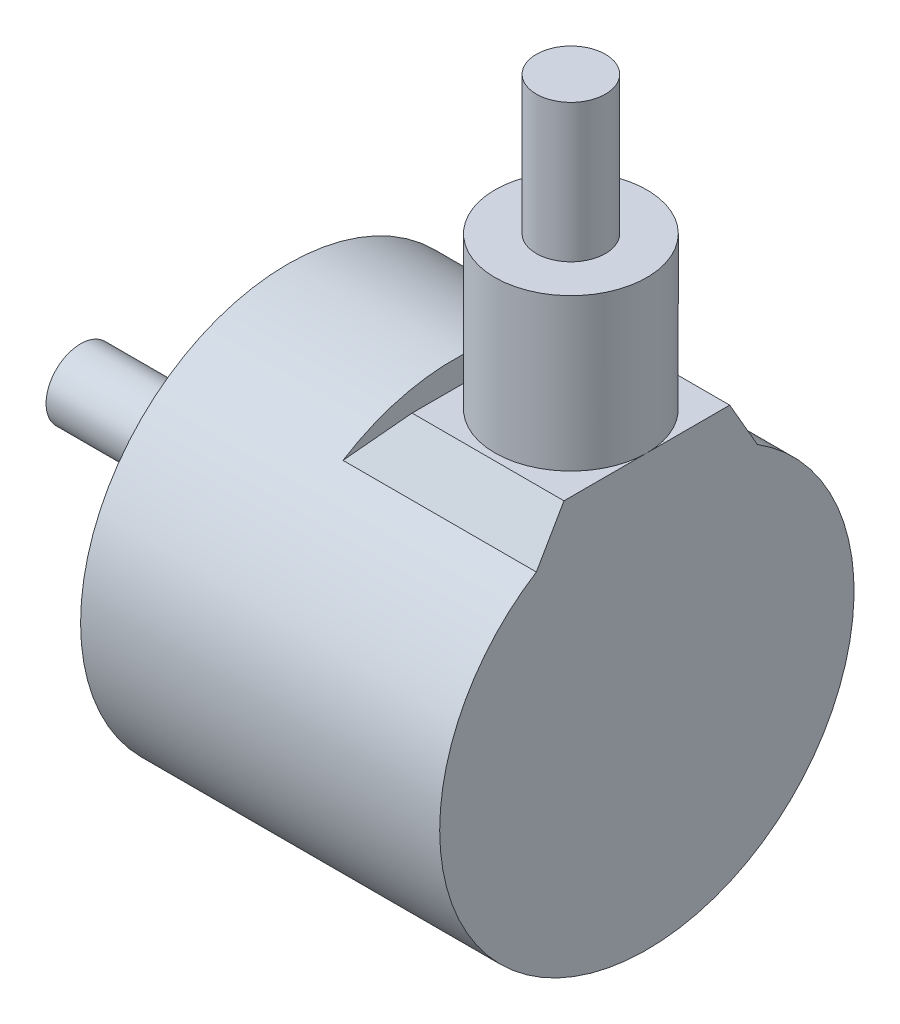
ISO-10303-21;
HEADER;
FILE_DESCRIPTION(('STEP AP214'),'2;1');
FILE_NAME('part.step','',(''),(''),'','','');
FILE_SCHEMA(('AUTOMOTIVE_DESIGN { 1 0 10303 214 1 1 1 1 }'));
ENDSEC;
DATA;
#1=APPLICATION_CONTEXT('core data for automotive mechanical design processes');
#2=APPLICATION_PROTOCOL_DEFINITION('international standard','automotive_design',2000,#1);
#3=PRODUCT_CONTEXT('',#1,'mechanical');
#4=PRODUCT('Part','Part','',(#3));
#5=PRODUCT_RELATED_PRODUCT_CATEGORY('part','',(#4));
#6=PRODUCT_DEFINITION_FORMATION('','',#4);
#7=PRODUCT_DEFINITION_CONTEXT('part definition',#1,'design');
#8=PRODUCT_DEFINITION('design','',#6,#7);
#9=PRODUCT_DEFINITION_SHAPE('','',#8);
#10=(LENGTH_UNIT() NAMED_UNIT(*) SI_UNIT(.MILLI.,.METRE.));
#11=(NAMED_UNIT(*) PLANE_ANGLE_UNIT() SI_UNIT($,.RADIAN.));
#12=(NAMED_UNIT(*) SI_UNIT($,.STERADIAN.) SOLID_ANGLE_UNIT());
#13=UNCERTAINTY_MEASURE_WITH_UNIT(LENGTH_MEASURE(1.E-05),#10,'distance_accuracy_value','');
#14=(GEOMETRIC_REPRESENTATION_CONTEXT(3) GLOBAL_UNCERTAINTY_ASSIGNED_CONTEXT((#13)) GLOBAL_UNIT_ASSIGNED_CONTEXT((#10,
#11,#12)) REPRESENTATION_CONTEXT('',''));
#15=CARTESIAN_POINT('',(0.,0.,0.));
#16=DIRECTION('',(0.,0.,1.));
#17=DIRECTION('',(1.,0.,0.));
#18=AXIS2_PLACEMENT_3D('',#15,#16,#17);
#19=CARTESIAN_POINT('',(-19.0552292361064,27.1526791555873,0.));
#20=DIRECTION('',(0.,1.,0.));
#21=DIRECTION('',(0.,0.,1.));
#22=AXIS2_PLACEMENT_3D('',#19,#20,#21);
#23=PLANE('',#22);
#24=CARTESIAN_POINT('',(-19.0552292361064,27.1526791555873,0.));
#25=DIRECTION('',(0.,1.,0.));
#26=DIRECTION('',(0.,0.,1.));
#27=AXIS2_PLACEMENT_3D('',#24,#25,#26);
#28=CIRCLE('',#27,5.5);
#29=CARTESIAN_POINT('',(-19.0552292361064,27.1526791555873,5.49999999999999));
#30=VERTEX_POINT('',#29);
#31=EDGE_CURVE('E103',#30,#30,#28,.T.);
#32=ORIENTED_EDGE('',*,*,#31,.T.);
#33=EDGE_LOOP('',(#32));
#34=FACE_BOUND('',#33,.T.);
#35=CARTESIAN_POINT('',(-19.0552292361064,27.1526791555873,0.));
#36=DIRECTION('',(0.,1.,0.));
#37=DIRECTION('',(0.,0.,1.));
#38=AXIS2_PLACEMENT_3D('',#35,#36,#37);
#39=CIRCLE('',#38,2.5);
#40=CARTESIAN_POINT('',(-19.0552292361064,27.1526791555873,2.49999999999999));
#41=VERTEX_POINT('',#40);
#42=EDGE_CURVE('E138',#41,#41,#39,.T.);
#43=ORIENTED_EDGE('',*,*,#42,.F.);
#44=EDGE_LOOP('',(#43));
#45=FACE_BOUND('',#44,.T.);
#46=ADVANCED_FACE('F33',(#34,#45),#23,.T.);
#47=CARTESIAN_POINT('',(-13.5552292361064,16.1526791555873,6.));
#48=DIRECTION('',(0.,-1.,0.));
#49=DIRECTION('',(0.,0.,-1.));
#50=AXIS2_PLACEMENT_3D('',#47,#48,#49);
#51=PLANE('',#50);
#52=CARTESIAN_POINT('',(-19.0552292361064,16.1526791555873,0.));
#53=DIRECTION('',(0.,1.,0.));
#54=DIRECTION('',(0.,0.,1.));
#55=AXIS2_PLACEMENT_3D('',#52,#53,#54);
#56=CIRCLE('',#55,5.5);
#57=CARTESIAN_POINT('',(-13.5552292361064,16.1526791555873,0.));
#58=VERTEX_POINT('',#57);
#59=CARTESIAN_POINT('',(-24.5552292361064,16.1526791555873,0.));
#60=VERTEX_POINT('',#59);
#61=EDGE_CURVE('E100',#58,#60,#56,.T.);
#62=ORIENTED_EDGE('',*,*,#61,.F.);
#63=DIRECTION('',(0.,0.,1.));
#64=VECTOR('',#63,1.);
#65=CARTESIAN_POINT('',(-13.5552292361064,16.1526791555873,6.));
#66=LINE('',#65,#64);
#67=CARTESIAN_POINT('',(-13.5552292361064,16.1526791555873,-6.));
#68=VERTEX_POINT('',#67);
#69=EDGE_CURVE('E81',#68,#58,#66,.T.);
#70=ORIENTED_EDGE('',*,*,#69,.F.);
#71=DIRECTION('',(-1.,0.,0.));
#72=VECTOR('',#71,1.);
#73=CARTESIAN_POINT('',(-13.5552292361064,16.1526791555873,-6.));
#74=LINE('',#73,#72);
#75=CARTESIAN_POINT('',(-24.5552292361064,16.1526791555873,-6.));
#76=VERTEX_POINT('',#75);
#77=EDGE_CURVE('E98',#68,#76,#74,.T.);
#78=ORIENTED_EDGE('',*,*,#77,.T.);
#79=DIRECTION('',(0.,0.,-1.));
#80=VECTOR('',#79,1.);
#81=CARTESIAN_POINT('',(-24.5552292361064,16.1526791555873,10.));
#82=LINE('',#81,#80);
#83=EDGE_CURVE('E54',#60,#76,#82,.T.);
#84=ORIENTED_EDGE('',*,*,#83,.F.);
#85=EDGE_LOOP('',(#62,#70,#78,#84));
#86=FACE_BOUND('',#85,.T.);
#87=ADVANCED_FACE('F101',(#86),#51,.F.);
#88=EDGE_CURVE('E12',#60,#58,#56,.T.);
#89=ORIENTED_EDGE('',*,*,#88,.F.);
#90=CARTESIAN_POINT('',(-24.5552292361064,16.1526791555873,6.));
#91=VERTEX_POINT('',#90);
#92=EDGE_CURVE('E147',#91,#60,#82,.T.);
#93=ORIENTED_EDGE('',*,*,#92,.F.);
#94=DIRECTION('',(-1.,0.,0.));
#95=VECTOR('',#94,1.);
#96=CARTESIAN_POINT('',(-13.5552292361064,16.1526791555873,6.));
#97=LINE('',#96,#95);
#98=CARTESIAN_POINT('',(-13.5552292361064,16.1526791555873,6.));
#99=VERTEX_POINT('',#98);
#100=EDGE_CURVE('E97',#99,#91,#97,.T.);
#101=ORIENTED_EDGE('',*,*,#100,.F.);
#102=EDGE_CURVE('E83',#58,#99,#66,.T.);
#103=ORIENTED_EDGE('',*,*,#102,.F.);
#104=EDGE_LOOP('',(#89,#93,#101,#103));
#105=FACE_BOUND('',#104,.T.);
#106=ADVANCED_FACE('F95',(#105),#51,.F.);
#107=CARTESIAN_POINT('',(-72.5210660272544,0.,0.));
#108=DIRECTION('',(-1.,0.,0.));
#109=DIRECTION('',(0.,0.,1.));
#110=AXIS2_PLACEMENT_3D('',#107,#108,#109);
#111=CYLINDRICAL_SURFACE('',#110,15.);
#112=CARTESIAN_POINT('',(-39.5552292361064,0.,0.));
#113=DIRECTION('',(-1.,0.,0.));
#114=DIRECTION('',(0.,0.,1.));
#115=AXIS2_PLACEMENT_3D('',#112,#113,#114);
#116=CIRCLE('',#115,15.);
#117=CARTESIAN_POINT('',(-39.5552292361064,0.,15.));
#118=VERTEX_POINT('',#117);
#119=EDGE_CURVE('E194',#118,#118,#116,.T.);
#120=ORIENTED_EDGE('',*,*,#119,.F.);
#121=EDGE_LOOP('',(#120));
#122=FACE_BOUND('',#121,.T.);
#123=DIRECTION('',(-1.,0.,0.));
#124=VECTOR('',#123,1.);
#125=CARTESIAN_POINT('',(-13.5552292361064,12.6885775404495,-8.));
#126=LINE('',#125,#124);
#127=CARTESIAN_POINT('',(-13.5552292361064,12.6885775404495,-7.99999999999999));
#128=VERTEX_POINT('',#127);
#129=CARTESIAN_POINT('',(-27.5552292361064,12.6885775404495,-8.00000000000001));
#130=VERTEX_POINT('',#129);
#131=EDGE_CURVE('E92',#128,#130,#126,.T.);
#132=ORIENTED_EDGE('',*,*,#131,.F.);
#133=CARTESIAN_POINT('',(-13.5552292361064,0.,0.));
#134=DIRECTION('',(-1.,0.,0.));
#135=DIRECTION('',(0.,0.,1.));
#136=AXIS2_PLACEMENT_3D('',#133,#134,#135);
#137=CIRCLE('',#136,15.);
#138=CARTESIAN_POINT('',(-13.5552292361064,12.6885775404495,8.));
#139=VERTEX_POINT('',#138);
#140=EDGE_CURVE('E197',#128,#139,#137,.T.);
#141=ORIENTED_EDGE('',*,*,#140,.T.);
#142=DIRECTION('',(-1.,0.,0.));
#143=VECTOR('',#142,1.);
#144=CARTESIAN_POINT('',(-13.5552292361064,12.6885775404495,8.));
#145=LINE('',#144,#143);
#146=CARTESIAN_POINT('',(-27.5552292361064,12.6885775404495,7.99999999999999));
#147=VERTEX_POINT('',#146);
#148=EDGE_CURVE('E152',#139,#147,#145,.T.);
#149=ORIENTED_EDGE('',*,*,#148,.T.);
#150=CARTESIAN_POINT('',(-27.5552292361064,0.,0.));
#151=DIRECTION('',(-1.,0.,0.));
#152=DIRECTION('',(0.,0.,1.));
#153=AXIS2_PLACEMENT_3D('',#150,#151,#152);
#154=CIRCLE('',#153,15.);
#155=EDGE_CURVE('E42',#147,#130,#154,.T.);
#156=ORIENTED_EDGE('',*,*,#155,.T.);
#157=EDGE_LOOP('',(#132,#141,#149,#156));
#158=FACE_BOUND('',#157,.T.);
#159=ADVANCED_FACE('F217',(#122,#158),#111,.T.);
#160=CARTESIAN_POINT('',(-39.5552292361064,15.,0.));
#161=DIRECTION('',(1.,0.,0.));
#162=DIRECTION('',(0.,0.,-1.));
#163=AXIS2_PLACEMENT_3D('',#160,#161,#162);
#164=PLANE('',#163);
#165=ORIENTED_EDGE('',*,*,#119,.T.);
#166=EDGE_LOOP('',(#165));
#167=FACE_BOUND('',#166,.T.);
#168=CARTESIAN_POINT('',(-39.5552292361064,-12.,0.));
#169=DIRECTION('',(-1.,0.,0.));
#170=DIRECTION('',(0.,0.,1.));
#171=AXIS2_PLACEMENT_3D('',#168,#169,#170);
#172=CIRCLE('',#171,1.5);
#173=CARTESIAN_POINT('',(-39.5552292361064,-12.,1.5));
#174=VERTEX_POINT('',#173);
#175=EDGE_CURVE('E183',#174,#174,#172,.T.);
#176=ORIENTED_EDGE('',*,*,#175,.F.);
#177=EDGE_LOOP('',(#176));
#178=FACE_BOUND('',#177,.T.);
#179=CARTESIAN_POINT('',(-39.5552292361064,6.00000000000005,10.3923048454132));
#180=DIRECTION('',(-1.,0.,0.));
#181=DIRECTION('',(0.,0.866025403784436,-0.500000000000004));
#182=AXIS2_PLACEMENT_3D('',#179,#180,#181);
#183=CIRCLE('',#182,1.5);
#184=CARTESIAN_POINT('',(-39.5552292361064,7.2990381056767,9.64230484541323));
#185=VERTEX_POINT('',#184);
#186=EDGE_CURVE('E176',#185,#185,#183,.T.);
#187=ORIENTED_EDGE('',*,*,#186,.F.);
#188=EDGE_LOOP('',(#187));
#189=FACE_BOUND('',#188,.T.);
#190=CARTESIAN_POINT('',(-39.5552292361064,5.9999999999999,-10.3923048454133));
#191=DIRECTION('',(-1.,0.,0.));
#192=DIRECTION('',(0.,-0.866025403784443,-0.499999999999992));
#193=AXIS2_PLACEMENT_3D('',#190,#191,#192);
#194=CIRCLE('',#193,1.5);
#195=CARTESIAN_POINT('',(-39.5552292361064,4.70096189432324,-11.1423048454133));
#196=VERTEX_POINT('',#195);
#197=EDGE_CURVE('E177',#196,#196,#194,.T.);
#198=ORIENTED_EDGE('',*,*,#197,.F.);
#199=EDGE_LOOP('',(#198));
#200=FACE_BOUND('',#199,.T.);
#201=CARTESIAN_POINT('',(-39.5552292361064,0.,0.));
#202=DIRECTION('',(1.,0.,0.));
#203=DIRECTION('',(0.,0.,-1.));
#204=AXIS2_PLACEMENT_3D('',#201,#202,#203);
#205=CIRCLE('',#204,8.);
#206=CARTESIAN_POINT('',(-39.5552292361064,0.,-8.));
#207=VERTEX_POINT('',#206);
#208=EDGE_CURVE('E200',#207,#207,#205,.F.);
#209=ORIENTED_EDGE('',*,*,#208,.F.);
#210=EDGE_LOOP('',(#209));
#211=FACE_BOUND('',#210,.T.);
#212=ADVANCED_FACE('F299',(#167,#178,#189,#200,#211),#164,.F.);
#213=CARTESIAN_POINT('',(-13.5552292361064,0.,0.));
#214=DIRECTION('',(-1.,0.,0.));
#215=DIRECTION('',(0.,0.,1.));
#216=AXIS2_PLACEMENT_3D('',#213,#214,#215);
#217=PLANE('',#216);
#218=DIRECTION('',(0.,-0.866025403784439,0.499999999999999));
#219=VECTOR('',#218,1.);
#220=CARTESIAN_POINT('',(-13.5552292361064,12.6885775404495,8.));
#221=LINE('',#220,#219);
#222=EDGE_CURVE('E166',#99,#139,#221,.T.);
#223=ORIENTED_EDGE('',*,*,#222,.T.);
#224=ORIENTED_EDGE('',*,*,#140,.F.);
#225=DIRECTION('',(0.,0.866025403784438,0.500000000000001));
#226=VECTOR('',#225,1.);
#227=CARTESIAN_POINT('',(-13.5552292361064,16.1526791555873,-6.));
#228=LINE('',#227,#226);
#229=EDGE_CURVE('E87',#128,#68,#228,.T.);
#230=ORIENTED_EDGE('',*,*,#229,.T.);
#231=ORIENTED_EDGE('',*,*,#69,.T.);
#232=ORIENTED_EDGE('',*,*,#102,.T.);
#233=EDGE_LOOP('',(#223,#224,#230,#231,#232));
#234=FACE_BOUND('',#233,.T.);
#235=ADVANCED_FACE('F35',(#234),#217,.F.);
#236=CARTESIAN_POINT('',(-34.5552292361064,-12.,0.));
#237=DIRECTION('',(-1.,0.,0.));
#238=DIRECTION('',(0.,0.,1.));
#239=AXIS2_PLACEMENT_3D('',#236,#237,#238);
#240=CYLINDRICAL_SURFACE('',#239,1.5);
#241=CARTESIAN_POINT('',(-34.5552292361064,-12.,0.));
#242=DIRECTION('',(-1.,0.,0.));
#243=DIRECTION('',(0.,0.,1.));
#244=AXIS2_PLACEMENT_3D('',#241,#242,#243);
#245=CIRCLE('',#244,1.5);
#246=CARTESIAN_POINT('',(-34.5552292361064,-12.,1.5));
#247=VERTEX_POINT('',#246);
#248=EDGE_CURVE('E186',#247,#247,#245,.T.);
#249=ORIENTED_EDGE('',*,*,#248,.F.);
#250=EDGE_LOOP('',(#249));
#251=FACE_BOUND('',#250,.T.);
#252=ORIENTED_EDGE('',*,*,#175,.T.);
#253=EDGE_LOOP('',(#252));
#254=FACE_BOUND('',#253,.T.);
#255=ADVANCED_FACE('F314',(#251,#254),#240,.F.);
#256=CARTESIAN_POINT('',(-34.5552292361064,-12.,0.));
#257=DIRECTION('',(-1.,0.,0.));
#258=DIRECTION('',(0.,0.,1.));
#259=AXIS2_PLACEMENT_3D('',#256,#257,#258);
#260=PLANE('',#259);
#261=ORIENTED_EDGE('',*,*,#248,.T.);
#262=EDGE_LOOP('',(#261));
#263=FACE_BOUND('',#262,.T.);
#264=ADVANCED_FACE('F318',(#263),#260,.T.);
#265=CARTESIAN_POINT('',(-34.5552292361064,6.00000000000005,10.3923048454132));
#266=DIRECTION('',(-1.,0.,0.));
#267=DIRECTION('',(0.,0.,1.));
#268=AXIS2_PLACEMENT_3D('',#265,#266,#267);
#269=CYLINDRICAL_SURFACE('',#268,1.5);
#270=CARTESIAN_POINT('',(-34.5552292361064,6.00000000000005,10.3923048454132));
#271=DIRECTION('',(-1.,0.,0.));
#272=DIRECTION('',(0.,0.866025403784436,-0.500000000000004));
#273=AXIS2_PLACEMENT_3D('',#270,#271,#272);
#274=CIRCLE('',#273,1.5);
#275=CARTESIAN_POINT('',(-34.5552292361064,7.2990381056767,9.64230484541323));
#276=VERTEX_POINT('',#275);
#277=EDGE_CURVE('E180',#276,#276,#274,.T.);
#278=ORIENTED_EDGE('',*,*,#277,.F.);
#279=EDGE_LOOP('',(#278));
#280=FACE_BOUND('',#279,.T.);
#281=ORIENTED_EDGE('',*,*,#186,.T.);
#282=EDGE_LOOP('',(#281));
#283=FACE_BOUND('',#282,.T.);
#284=ADVANCED_FACE('F327',(#280,#283),#269,.F.);
#285=CARTESIAN_POINT('',(-34.5552292361064,6.00000000000005,10.3923048454132));
#286=DIRECTION('',(-1.,0.,0.));
#287=DIRECTION('',(0.,0.866025403784436,-0.500000000000004));
#288=AXIS2_PLACEMENT_3D('',#285,#286,#287);
#289=PLANE('',#288);
#290=ORIENTED_EDGE('',*,*,#277,.T.);
#291=EDGE_LOOP('',(#290));
#292=FACE_BOUND('',#291,.T.);
#293=ADVANCED_FACE('F335',(#292),#289,.T.);
#294=CARTESIAN_POINT('',(-34.5552292361064,5.9999999999999,-10.3923048454133));
#295=DIRECTION('',(-1.,0.,0.));
#296=DIRECTION('',(0.,0.,1.));
#297=AXIS2_PLACEMENT_3D('',#294,#295,#296);
#298=CYLINDRICAL_SURFACE('',#297,1.5);
#299=CARTESIAN_POINT('',(-34.5552292361064,5.9999999999999,-10.3923048454133));
#300=DIRECTION('',(-1.,0.,0.));
#301=DIRECTION('',(0.,-0.866025403784443,-0.499999999999992));
#302=AXIS2_PLACEMENT_3D('',#299,#300,#301);
#303=CIRCLE('',#302,1.5);
#304=CARTESIAN_POINT('',(-34.5552292361064,4.70096189432324,-11.1423048454133));
#305=VERTEX_POINT('',#304);
#306=EDGE_CURVE('E173',#305,#305,#303,.T.);
#307=ORIENTED_EDGE('',*,*,#306,.F.);
#308=EDGE_LOOP('',(#307));
#309=FACE_BOUND('',#308,.T.);
#310=ORIENTED_EDGE('',*,*,#197,.T.);
#311=EDGE_LOOP('',(#310));
#312=FACE_BOUND('',#311,.T.);
#313=ADVANCED_FACE('F343',(#309,#312),#298,.F.);
#314=CARTESIAN_POINT('',(-34.5552292361064,5.9999999999999,-10.3923048454133));
#315=DIRECTION('',(-1.,0.,0.));
#316=DIRECTION('',(0.,-0.866025403784443,-0.499999999999992));
#317=AXIS2_PLACEMENT_3D('',#314,#315,#316);
#318=PLANE('',#317);
#319=ORIENTED_EDGE('',*,*,#306,.T.);
#320=EDGE_LOOP('',(#319));
#321=FACE_BOUND('',#320,.T.);
#322=ADVANCED_FACE('F351',(#321),#318,.T.);
#323=CARTESIAN_POINT('',(-41.5552292361064,0.,0.));
#324=DIRECTION('',(-1.,0.,0.));
#325=DIRECTION('',(0.,0.,1.));
#326=AXIS2_PLACEMENT_3D('',#323,#324,#325);
#327=PLANE('',#326);
#328=CARTESIAN_POINT('',(-41.5552292361064,0.,0.));
#329=DIRECTION('',(-1.,0.,0.));
#330=DIRECTION('',(0.,0.,1.));
#331=AXIS2_PLACEMENT_3D('',#328,#329,#330);
#332=CIRCLE('',#331,8.);
#333=CARTESIAN_POINT('',(-41.5552292361064,0.,8.));
#334=VERTEX_POINT('',#333);
#335=EDGE_CURVE('E169',#334,#334,#332,.T.);
#336=ORIENTED_EDGE('',*,*,#335,.T.);
#337=EDGE_LOOP('',(#336));
#338=FACE_BOUND('',#337,.T.);
#339=CARTESIAN_POINT('',(-41.5552292361064,0.,0.));
#340=DIRECTION('',(-1.,0.,0.));
#341=DIRECTION('',(0.,0.,1.));
#342=AXIS2_PLACEMENT_3D('',#339,#340,#341);
#343=CIRCLE('',#342,2.49999999999999);
#344=CARTESIAN_POINT('',(-41.5552292361064,0.,2.49999999999999));
#345=VERTEX_POINT('',#344);
#346=EDGE_CURVE('E172',#345,#345,#343,.T.);
#347=ORIENTED_EDGE('',*,*,#346,.F.);
#348=EDGE_LOOP('',(#347));
#349=FACE_BOUND('',#348,.T.);
#350=ADVANCED_FACE('F358',(#338,#349),#327,.T.);
#351=CARTESIAN_POINT('',(-41.5552292361064,0.,0.));
#352=DIRECTION('',(1.,0.,0.));
#353=DIRECTION('',(0.,0.,-1.));
#354=AXIS2_PLACEMENT_3D('',#351,#352,#353);
#355=CYLINDRICAL_SURFACE('',#354,8.);
#356=ORIENTED_EDGE('',*,*,#335,.F.);
#357=EDGE_LOOP('',(#356));
#358=FACE_BOUND('',#357,.T.);
#359=ORIENTED_EDGE('',*,*,#208,.T.);
#360=EDGE_LOOP('',(#359));
#361=FACE_BOUND('',#360,.T.);
#362=ADVANCED_FACE('F365',(#358,#361),#355,.T.);
#363=CARTESIAN_POINT('',(-54.5552292361064,2.49999999999999,0.));
#364=DIRECTION('',(1.,0.,0.));
#365=DIRECTION('',(0.,0.,-1.));
#366=AXIS2_PLACEMENT_3D('',#363,#364,#365);
#367=PLANE('',#366);
#368=CARTESIAN_POINT('',(-54.5552292361064,0.,0.));
#369=DIRECTION('',(-1.,0.,0.));
#370=DIRECTION('',(0.,0.,1.));
#371=AXIS2_PLACEMENT_3D('',#368,#369,#370);
#372=CIRCLE('',#371,2.49999999999999);
#373=CARTESIAN_POINT('',(-54.5552292361064,0.,2.49999999999999));
#374=VERTEX_POINT('',#373);
#375=EDGE_CURVE('E189',#374,#374,#372,.T.);
#376=ORIENTED_EDGE('',*,*,#375,.T.);
#377=EDGE_LOOP('',(#376));
#378=FACE_BOUND('',#377,.T.);
#379=ADVANCED_FACE('F243',(#378),#367,.F.);
#380=CARTESIAN_POINT('',(-72.5210660272544,0.,0.));
#381=DIRECTION('',(-1.,0.,0.));
#382=DIRECTION('',(0.,0.,1.));
#383=AXIS2_PLACEMENT_3D('',#380,#381,#382);
#384=CYLINDRICAL_SURFACE('',#383,2.49999999999999);
#385=ORIENTED_EDGE('',*,*,#346,.T.);
#386=EDGE_LOOP('',(#385));
#387=FACE_BOUND('',#386,.T.);
#388=ORIENTED_EDGE('',*,*,#375,.F.);
#389=EDGE_LOOP('',(#388));
#390=FACE_BOUND('',#389,.T.);
#391=ADVANCED_FACE('F236',(#387,#390),#384,.T.);
#392=CARTESIAN_POINT('',(-13.5552292361064,12.6885775404495,8.));
#393=DIRECTION('',(0.,-0.499999999999999,-0.866025403784439));
#394=DIRECTION('',(0.,0.866025403784439,-0.499999999999999));
#395=AXIS2_PLACEMENT_3D('',#392,#393,#394);
#396=PLANE('',#395);
#397=ORIENTED_EDGE('',*,*,#100,.T.);
#398=DIRECTION('',(-0.599999999999996,-0.692820323027554,0.400000000000001));
#399=VECTOR('',#398,1.);
#400=CARTESIAN_POINT('',(-22.5152292361065,18.5082682538809,4.64000000000002));
#401=LINE('',#400,#399);
#402=EDGE_CURVE('E155',#91,#147,#401,.T.);
#403=ORIENTED_EDGE('',*,*,#402,.T.);
#404=ORIENTED_EDGE('',*,*,#148,.F.);
#405=ORIENTED_EDGE('',*,*,#222,.F.);
#406=EDGE_LOOP('',(#397,#403,#404,#405));
#407=FACE_BOUND('',#406,.T.);
#408=ADVANCED_FACE('F234',(#407),#396,.F.);
#409=CARTESIAN_POINT('',(-13.5552292361064,16.1526791555873,-6.));
#410=DIRECTION('',(0.,-0.500000000000001,0.866025403784438));
#411=DIRECTION('',(0.,-0.866025403784438,-0.500000000000001));
#412=AXIS2_PLACEMENT_3D('',#409,#410,#411);
#413=PLANE('',#412);
#414=ORIENTED_EDGE('',*,*,#131,.T.);
#415=DIRECTION('',(-0.599999999999996,-0.692820323027554,-0.400000000000002));
#416=VECTOR('',#415,1.);
#417=CARTESIAN_POINT('',(-27.5552292361064,12.6885775404495,-8.00000000000001));
#418=LINE('',#417,#416);
#419=EDGE_CURVE('E143',#76,#130,#418,.T.);
#420=ORIENTED_EDGE('',*,*,#419,.F.);
#421=ORIENTED_EDGE('',*,*,#77,.F.);
#422=ORIENTED_EDGE('',*,*,#229,.F.);
#423=EDGE_LOOP('',(#414,#420,#421,#422));
#424=FACE_BOUND('',#423,.T.);
#425=ADVANCED_FACE('F220',(#424),#413,.F.);
#426=CARTESIAN_POINT('',(-27.5552292361064,16.1526791555873,10.));
#427=DIRECTION('',(-1.,0.,0.));
#428=DIRECTION('',(0.,-1.,0.));
#429=AXIS2_PLACEMENT_3D('',#426,#427,#428);
#430=PLANE('',#429);
#431=DIRECTION('',(0.,0.,-1.));
#432=VECTOR('',#431,1.);
#433=CARTESIAN_POINT('',(-27.5552292361064,12.6885775404495,7.99999999999999));
#434=LINE('',#433,#432);
#435=EDGE_CURVE('E149',#147,#130,#434,.T.);
#436=ORIENTED_EDGE('',*,*,#435,.T.);
#437=ORIENTED_EDGE('',*,*,#155,.F.);
#438=EDGE_LOOP('',(#436,#437));
#439=FACE_BOUND('',#438,.T.);
#440=ADVANCED_FACE('F119',(#439),#430,.F.);
#441=CARTESIAN_POINT('',(-27.5552292361064,12.6885775404495,7.99999999999999));
#442=DIRECTION('',(0.755928946018458,-0.654653670707973,0.));
#443=DIRECTION('',(0.654653670707973,0.755928946018458,0.));
#444=AXIS2_PLACEMENT_3D('',#441,#442,#443);
#445=PLANE('',#444);
#446=ORIENTED_EDGE('',*,*,#92,.T.);
#447=ORIENTED_EDGE('',*,*,#83,.T.);
#448=ORIENTED_EDGE('',*,*,#419,.T.);
#449=ORIENTED_EDGE('',*,*,#435,.F.);
#450=ORIENTED_EDGE('',*,*,#402,.F.);
#451=EDGE_LOOP('',(#446,#447,#448,#449,#450));
#452=FACE_BOUND('',#451,.T.);
#453=ADVANCED_FACE('F109',(#452),#445,.F.);
#454=CARTESIAN_POINT('',(-19.0552292361064,27.1526791555873,0.));
#455=DIRECTION('',(0.,-1.,0.));
#456=DIRECTION('',(0.,0.,-1.));
#457=AXIS2_PLACEMENT_3D('',#454,#455,#456);
#458=CYLINDRICAL_SURFACE('',#457,5.5);
#459=ORIENTED_EDGE('',*,*,#31,.F.);
#460=EDGE_LOOP('',(#459));
#461=FACE_BOUND('',#460,.T.);
#462=ORIENTED_EDGE('',*,*,#61,.T.);
#463=ORIENTED_EDGE('',*,*,#88,.T.);
#464=EDGE_LOOP('',(#462,#463));
#465=FACE_BOUND('',#464,.T.);
#466=ADVANCED_FACE('F106',(#461,#465),#458,.T.);
#467=CARTESIAN_POINT('',(-19.0552292361064,37.1526791555873,0.));
#468=DIRECTION('',(0.,-1.,0.));
#469=DIRECTION('',(0.,0.,-1.));
#470=AXIS2_PLACEMENT_3D('',#467,#468,#469);
#471=CYLINDRICAL_SURFACE('',#470,2.5);
#472=CARTESIAN_POINT('',(-19.0552292361064,37.1526791555873,0.));
#473=DIRECTION('',(0.,1.,0.));
#474=DIRECTION('',(0.,0.,1.));
#475=AXIS2_PLACEMENT_3D('',#472,#473,#474);
#476=CIRCLE('',#475,2.5);
#477=CARTESIAN_POINT('',(-19.0552292361064,37.1526791555873,2.49999999999999));
#478=VERTEX_POINT('',#477);
#479=EDGE_CURVE('E104',#478,#478,#476,.T.);
#480=ORIENTED_EDGE('',*,*,#479,.F.);
#481=EDGE_LOOP('',(#480));
#482=FACE_BOUND('',#481,.T.);
#483=ORIENTED_EDGE('',*,*,#42,.T.);
#484=EDGE_LOOP('',(#483));
#485=FACE_BOUND('',#484,.T.);
#486=ADVANCED_FACE('F108',(#482,#485),#471,.T.);
#487=CARTESIAN_POINT('',(-19.0552292361064,37.1526791555873,0.));
#488=DIRECTION('',(0.,1.,0.));
#489=DIRECTION('',(0.,0.,1.));
#490=AXIS2_PLACEMENT_3D('',#487,#488,#489);
#491=PLANE('',#490);
#492=ORIENTED_EDGE('',*,*,#479,.T.);
#493=EDGE_LOOP('',(#492));
#494=FACE_BOUND('',#493,.T.);
#495=ADVANCED_FACE('F116',(#494),#491,.T.);
#496=CLOSED_SHELL('',(#46,#87,#106,#159,#212,#235,#255,#264,#284,#293,#313,#322,#350,#362,#379,
#391,#408,#425,#440,#453,#466,#486,#495));
#497=MANIFOLD_SOLID_BREP('B2',#496);
#498=ADVANCED_BREP_SHAPE_REPRESENTATION('',(#18,#497),#14);
#499=SHAPE_DEFINITION_REPRESENTATION(#9,#498);
ENDSEC;
END-ISO-10303-21;
